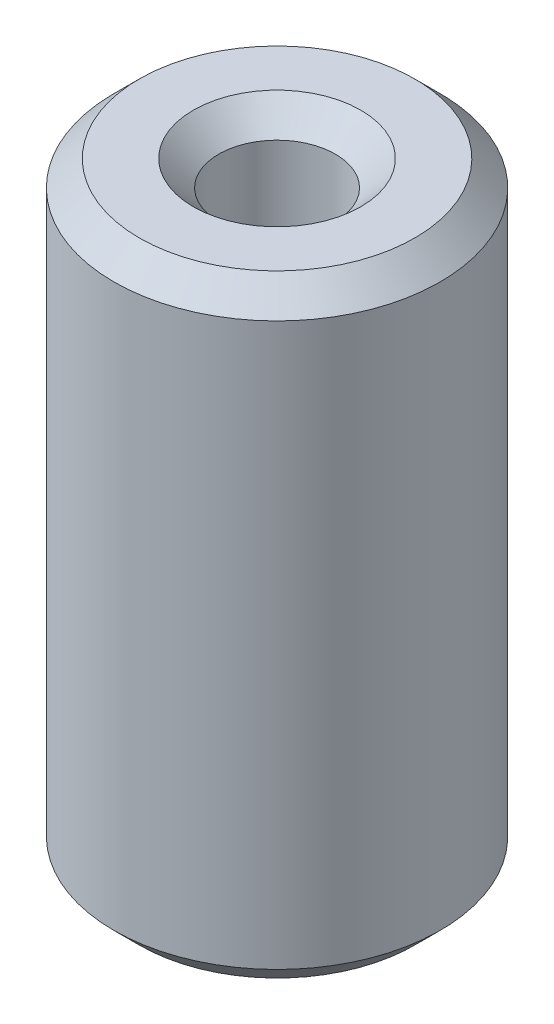
ISO-10303-21;
HEADER;
FILE_DESCRIPTION(('STEP AP214'),'2;1');
FILE_NAME('part.step','',(''),(''),'','','');
FILE_SCHEMA(('AUTOMOTIVE_DESIGN { 1 0 10303 214 1 1 1 1 }'));
ENDSEC;
DATA;
#1=APPLICATION_CONTEXT('core data for automotive mechanical design processes');
#2=APPLICATION_PROTOCOL_DEFINITION('international standard','automotive_design',2000,#1);
#3=PRODUCT_CONTEXT('',#1,'mechanical');
#4=PRODUCT('Part','Part','',(#3));
#5=PRODUCT_RELATED_PRODUCT_CATEGORY('part','',(#4));
#6=PRODUCT_DEFINITION_FORMATION('','',#4);
#7=PRODUCT_DEFINITION_CONTEXT('part definition',#1,'design');
#8=PRODUCT_DEFINITION('design','',#6,#7);
#9=PRODUCT_DEFINITION_SHAPE('','',#8);
#10=(LENGTH_UNIT() NAMED_UNIT(*) SI_UNIT(.MILLI.,.METRE.));
#11=(NAMED_UNIT(*) PLANE_ANGLE_UNIT() SI_UNIT($,.RADIAN.));
#12=(NAMED_UNIT(*) SI_UNIT($,.STERADIAN.) SOLID_ANGLE_UNIT());
#13=UNCERTAINTY_MEASURE_WITH_UNIT(LENGTH_MEASURE(1.E-05),#10,'distance_accuracy_value','');
#14=(GEOMETRIC_REPRESENTATION_CONTEXT(3) GLOBAL_UNCERTAINTY_ASSIGNED_CONTEXT((#13)) GLOBAL_UNIT_ASSIGNED_CONTEXT((#10,
#11,#12)) REPRESENTATION_CONTEXT('',''));
#15=CARTESIAN_POINT('',(0.,0.,0.));
#16=DIRECTION('',(0.,0.,1.));
#17=DIRECTION('',(1.,0.,0.));
#18=AXIS2_PLACEMENT_3D('',#15,#16,#17);
#19=CARTESIAN_POINT('',(0.,56.3137206260423,0.));
#20=DIRECTION('',(0.,-1.,0.));
#21=DIRECTION('',(0.,0.,-1.));
#22=AXIS2_PLACEMENT_3D('',#19,#20,#21);
#23=CYLINDRICAL_SURFACE('',#22,15.);
#24=CARTESIAN_POINT('',(0.,2.33458342712849,0.));
#25=DIRECTION('',(0.,1.,0.));
#26=DIRECTION('',(0.,0.,1.));
#27=AXIS2_PLACEMENT_3D('',#24,#25,#26);
#28=CIRCLE('',#27,15.);
#29=CARTESIAN_POINT('',(0.,2.33458342712849,15.));
#30=VERTEX_POINT('',#29);
#31=EDGE_CURVE('E10',#30,#30,#28,.T.);
#32=ORIENTED_EDGE('',*,*,#31,.T.);
#33=EDGE_LOOP('',(#32));
#34=FACE_BOUND('',#33,.T.);
#35=CARTESIAN_POINT('',(0.,53.9791371989138,0.));
#36=DIRECTION('',(0.,1.,0.));
#37=DIRECTION('',(0.,0.,1.));
#38=AXIS2_PLACEMENT_3D('',#35,#36,#37);
#39=CIRCLE('',#38,15.);
#40=CARTESIAN_POINT('',(0.,53.9791371989138,15.));
#41=VERTEX_POINT('',#40);
#42=EDGE_CURVE('E50',#41,#41,#39,.F.);
#43=ORIENTED_EDGE('',*,*,#42,.T.);
#44=EDGE_LOOP('',(#43));
#45=FACE_BOUND('',#44,.T.);
#46=ADVANCED_FACE('F39',(#34,#45),#23,.T.);
#47=CARTESIAN_POINT('',(0.,56.3137206260423,0.));
#48=DIRECTION('',(0.,1.,0.));
#49=DIRECTION('',(0.,0.,1.));
#50=AXIS2_PLACEMENT_3D('',#47,#48,#49);
#51=PLANE('',#50);
#52=CARTESIAN_POINT('',(0.,56.3137206260423,0.));
#53=DIRECTION('',(0.,1.,0.));
#54=DIRECTION('',(0.,0.,1.));
#55=AXIS2_PLACEMENT_3D('',#52,#53,#54);
#56=CIRCLE('',#55,7.69870499726141);
#57=CARTESIAN_POINT('',(0.,56.3137206260423,7.69870499726141));
#58=VERTEX_POINT('',#57);
#59=EDGE_CURVE('E58',#58,#58,#56,.F.);
#60=ORIENTED_EDGE('',*,*,#59,.T.);
#61=EDGE_LOOP('',(#60));
#62=FACE_BOUND('',#61,.T.);
#63=CARTESIAN_POINT('',(0.,56.3137206260423,0.));
#64=DIRECTION('',(0.,1.,0.));
#65=DIRECTION('',(0.,0.,1.));
#66=AXIS2_PLACEMENT_3D('',#63,#64,#65);
#67=CIRCLE('',#66,12.6654165728715);
#68=CARTESIAN_POINT('',(0.,56.3137206260423,12.6654165728715));
#69=VERTEX_POINT('',#68);
#70=EDGE_CURVE('E61',#69,#69,#67,.T.);
#71=ORIENTED_EDGE('',*,*,#70,.T.);
#72=EDGE_LOOP('',(#71));
#73=FACE_BOUND('',#72,.T.);
#74=ADVANCED_FACE('F88',(#62,#73),#51,.T.);
#75=CARTESIAN_POINT('',(0.,0.,0.));
#76=DIRECTION('',(0.,1.,0.));
#77=DIRECTION('',(0.,0.,1.));
#78=AXIS2_PLACEMENT_3D('',#75,#76,#77);
#79=PLANE('',#78);
#80=CARTESIAN_POINT('',(0.,0.,0.));
#81=DIRECTION('',(0.,1.,0.));
#82=DIRECTION('',(0.,0.,1.));
#83=AXIS2_PLACEMENT_3D('',#80,#81,#82);
#84=CIRCLE('',#83,7.69870499726139);
#85=CARTESIAN_POINT('',(0.,0.,7.69870499726139));
#86=VERTEX_POINT('',#85);
#87=EDGE_CURVE('E51',#86,#86,#84,.T.);
#88=ORIENTED_EDGE('',*,*,#87,.T.);
#89=EDGE_LOOP('',(#88));
#90=FACE_BOUND('',#89,.T.);
#91=CARTESIAN_POINT('',(0.,0.,0.));
#92=DIRECTION('',(0.,1.,0.));
#93=DIRECTION('',(0.,0.,1.));
#94=AXIS2_PLACEMENT_3D('',#91,#92,#93);
#95=CIRCLE('',#94,12.6654165728715);
#96=CARTESIAN_POINT('',(0.,0.,12.6654165728715));
#97=VERTEX_POINT('',#96);
#98=EDGE_CURVE('E54',#97,#97,#95,.F.);
#99=ORIENTED_EDGE('',*,*,#98,.T.);
#100=EDGE_LOOP('',(#99));
#101=FACE_BOUND('',#100,.T.);
#102=ADVANCED_FACE('F83',(#90,#101),#79,.F.);
#103=CARTESIAN_POINT('',(0.,56.3137206260423,0.));
#104=DIRECTION('',(0.,-1.,0.));
#105=DIRECTION('',(0.,0.,-1.));
#106=AXIS2_PLACEMENT_3D('',#103,#104,#105);
#107=CYLINDRICAL_SURFACE('',#106,5.36412157013288);
#108=CARTESIAN_POINT('',(0.,53.9791371989138,0.));
#109=DIRECTION('',(0.,1.,0.));
#110=DIRECTION('',(0.,0.,1.));
#111=AXIS2_PLACEMENT_3D('',#108,#109,#110);
#112=CIRCLE('',#111,5.36412157013288);
#113=CARTESIAN_POINT('',(0.,53.9791371989138,5.36412157013288));
#114=VERTEX_POINT('',#113);
#115=EDGE_CURVE('E67',#114,#114,#112,.T.);
#116=ORIENTED_EDGE('',*,*,#115,.T.);
#117=EDGE_LOOP('',(#116));
#118=FACE_BOUND('',#117,.T.);
#119=CARTESIAN_POINT('',(0.,2.33458342712852,0.));
#120=DIRECTION('',(0.,1.,0.));
#121=DIRECTION('',(0.,0.,1.));
#122=AXIS2_PLACEMENT_3D('',#119,#120,#121);
#123=CIRCLE('',#122,5.36412157013288);
#124=CARTESIAN_POINT('',(0.,2.33458342712852,5.36412157013288));
#125=VERTEX_POINT('',#124);
#126=EDGE_CURVE('E69',#125,#125,#123,.F.);
#127=ORIENTED_EDGE('',*,*,#126,.T.);
#128=EDGE_LOOP('',(#127));
#129=FACE_BOUND('',#128,.T.);
#130=ADVANCED_FACE('F71',(#118,#129),#107,.F.);
#131=CARTESIAN_POINT('',(0.,53.9791371989138,0.));
#132=DIRECTION('',(0.,1.,0.));
#133=DIRECTION('',(0.,0.,1.));
#134=AXIS2_PLACEMENT_3D('',#131,#132,#133);
#135=CONICAL_SURFACE('',#134,5.36412157013288,0.78539816339745);
#136=ORIENTED_EDGE('',*,*,#59,.F.);
#137=EDGE_LOOP('',(#136));
#138=FACE_BOUND('',#137,.T.);
#139=ORIENTED_EDGE('',*,*,#115,.F.);
#140=EDGE_LOOP('',(#139));
#141=FACE_BOUND('',#140,.T.);
#142=ADVANCED_FACE('F77',(#138,#141),#135,.F.);
#143=CARTESIAN_POINT('',(0.,0.,0.));
#144=DIRECTION('',(0.,-1.,0.));
#145=DIRECTION('',(0.,0.,-1.));
#146=AXIS2_PLACEMENT_3D('',#143,#144,#145);
#147=CONICAL_SURFACE('',#146,7.69870499726139,0.785398163397444);
#148=ORIENTED_EDGE('',*,*,#126,.F.);
#149=EDGE_LOOP('',(#148));
#150=FACE_BOUND('',#149,.T.);
#151=ORIENTED_EDGE('',*,*,#87,.F.);
#152=EDGE_LOOP('',(#151));
#153=FACE_BOUND('',#152,.T.);
#154=ADVANCED_FACE('F73',(#150,#153),#147,.F.);
#155=CARTESIAN_POINT('',(0.,2.33458342712849,0.));
#156=DIRECTION('',(0.,1.,0.));
#157=DIRECTION('',(0.,0.,1.));
#158=AXIS2_PLACEMENT_3D('',#155,#156,#157);
#159=CONICAL_SURFACE('',#158,15.,0.785398163397451);
#160=ORIENTED_EDGE('',*,*,#98,.F.);
#161=EDGE_LOOP('',(#160));
#162=FACE_BOUND('',#161,.T.);
#163=ORIENTED_EDGE('',*,*,#31,.F.);
#164=EDGE_LOOP('',(#163));
#165=FACE_BOUND('',#164,.T.);
#166=ADVANCED_FACE('F76',(#162,#165),#159,.T.);
#167=CARTESIAN_POINT('',(0.,56.3137206260423,0.));
#168=DIRECTION('',(0.,-1.,0.));
#169=DIRECTION('',(0.,0.,-1.));
#170=AXIS2_PLACEMENT_3D('',#167,#168,#169);
#171=CONICAL_SURFACE('',#170,12.6654165728715,0.785398163397447);
#172=ORIENTED_EDGE('',*,*,#42,.F.);
#173=EDGE_LOOP('',(#172));
#174=FACE_BOUND('',#173,.T.);
#175=ORIENTED_EDGE('',*,*,#70,.F.);
#176=EDGE_LOOP('',(#175));
#177=FACE_BOUND('',#176,.T.);
#178=ADVANCED_FACE('F45',(#174,#177),#171,.T.);
#179=CLOSED_SHELL('',(#46,#74,#102,#130,#142,#154,#166,#178));
#180=MANIFOLD_SOLID_BREP('B2',#179);
#181=ADVANCED_BREP_SHAPE_REPRESENTATION('',(#18,#180),#14);
#182=SHAPE_DEFINITION_REPRESENTATION(#9,#181);
ENDSEC;
END-ISO-10303-21;
